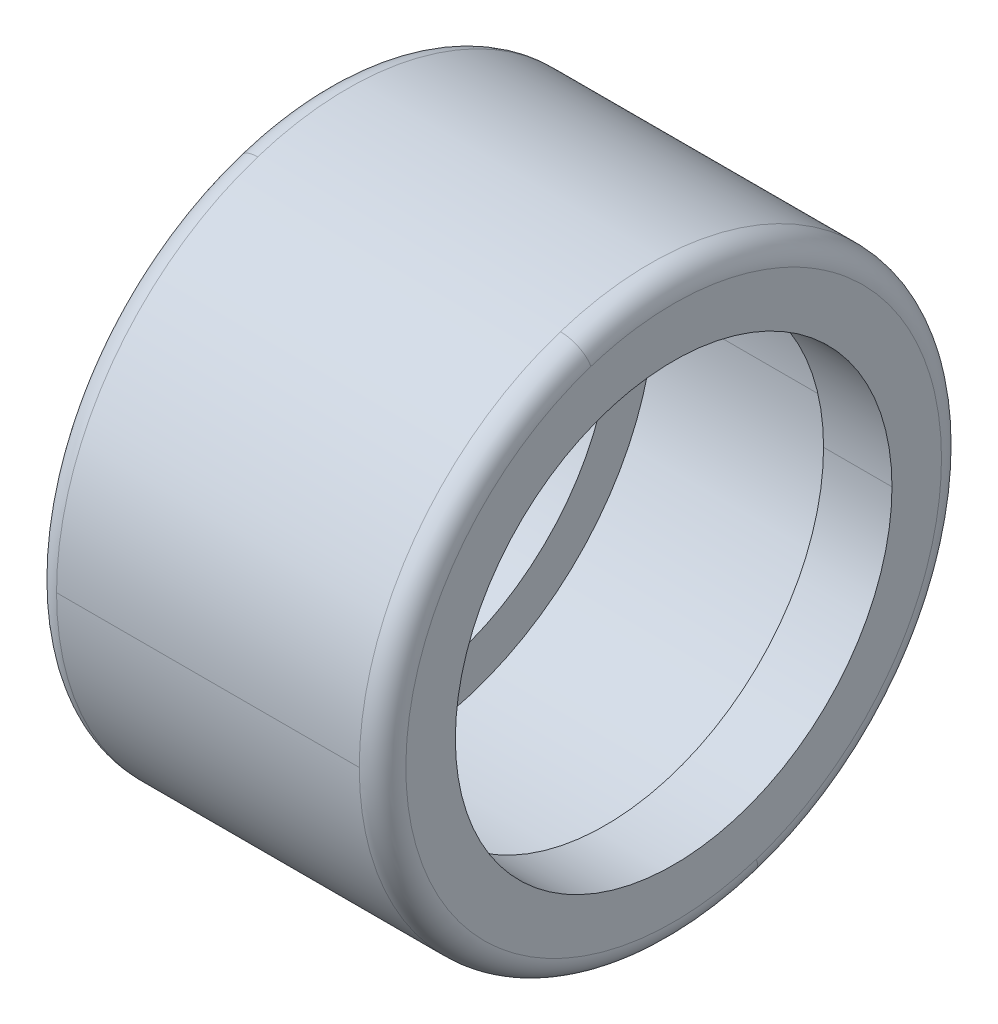
ISO-10303-21;
HEADER;
FILE_DESCRIPTION(('STEP AP214'),'2;1');
FILE_NAME('part.step','',(''),(''),'','','');
FILE_SCHEMA(('AUTOMOTIVE_DESIGN { 1 0 10303 214 1 1 1 1 }'));
ENDSEC;
DATA;
#1=APPLICATION_CONTEXT('core data for automotive mechanical design processes');
#2=APPLICATION_PROTOCOL_DEFINITION('international standard','automotive_design',2000,#1);
#3=PRODUCT_CONTEXT('',#1,'mechanical');
#4=PRODUCT('Part','Part','',(#3));
#5=PRODUCT_RELATED_PRODUCT_CATEGORY('part','',(#4));
#6=PRODUCT_DEFINITION_FORMATION('','',#4);
#7=PRODUCT_DEFINITION_CONTEXT('part definition',#1,'design');
#8=PRODUCT_DEFINITION('design','',#6,#7);
#9=PRODUCT_DEFINITION_SHAPE('','',#8);
#10=(LENGTH_UNIT() NAMED_UNIT(*) SI_UNIT(.MILLI.,.METRE.));
#11=(NAMED_UNIT(*) PLANE_ANGLE_UNIT() SI_UNIT($,.RADIAN.));
#12=(NAMED_UNIT(*) SI_UNIT($,.STERADIAN.) SOLID_ANGLE_UNIT());
#13=UNCERTAINTY_MEASURE_WITH_UNIT(LENGTH_MEASURE(1.E-05),#10,'distance_accuracy_value','');
#14=(GEOMETRIC_REPRESENTATION_CONTEXT(3) GLOBAL_UNCERTAINTY_ASSIGNED_CONTEXT((#13)) GLOBAL_UNIT_ASSIGNED_CONTEXT((#10,
#11,#12)) REPRESENTATION_CONTEXT('',''));
#15=CARTESIAN_POINT('',(0.,0.,0.));
#16=DIRECTION('',(0.,0.,1.));
#17=DIRECTION('',(1.,0.,0.));
#18=AXIS2_PLACEMENT_3D('',#15,#16,#17);
#19=CARTESIAN_POINT('',(0.80000000000006,0.,0.));
#20=DIRECTION('',(1.,0.,0.));
#21=DIRECTION('',(0.,-0.309016994374947,0.951056516295154));
#22=AXIS2_PLACEMENT_3D('',#19,#20,#21);
#23=TOROIDAL_SURFACE('',#22,9.2,0.800000000000061);
#24=CARTESIAN_POINT('',(0.80000000000006,-8.74971994991541,-2.84295634824951));
#25=DIRECTION('',(0.,0.309016994374947,-0.951056516295154));
#26=DIRECTION('',(0.,-0.951056516295154,-0.309016994374947));
#27=AXIS2_PLACEMENT_3D('',#24,#25,#26);
#28=CIRCLE('',#27,0.800000000000061);
#29=CARTESIAN_POINT('',(0.799999999999998,-9.51056516295159,-3.09016994374949));
#30=VERTEX_POINT('',#29);
#31=CARTESIAN_POINT('',(0.,-8.74971994991541,-2.84295634824951));
#32=VERTEX_POINT('',#31);
#33=EDGE_CURVE('E11',#30,#32,#28,.T.);
#34=ORIENTED_EDGE('',*,*,#33,.T.);
#35=CARTESIAN_POINT('',(0.,-8.74971994991541,-2.84295634824951));
#36=CARTESIAN_POINT('',(0.,-8.7032051754001,-2.98612443747712));
#37=CARTESIAN_POINT('',(0.,-8.65317067329749,-3.12814861219191));
#38=CARTESIAN_POINT('',(0.,-8.54619587234309,-3.40957197136774));
#39=CARTESIAN_POINT('',(0.,-8.48925557349131,-3.54897115582878));
#40=CARTESIAN_POINT('',(0.,-8.36860283746399,-3.824807373269));
#41=CARTESIAN_POINT('',(0.,-8.30489040028846,-3.96124440624817));
#42=CARTESIAN_POINT('',(0.,-8.17084781849556,-4.23082799004443));
#43=CARTESIAN_POINT('',(0.,-8.10051767387819,-4.36397454086151));
#44=CARTESIAN_POINT('',(0.,-7.95340885626128,-4.62665630268244));
#45=CARTESIAN_POINT('',(0.,-7.87663018326173,-4.75619151368629));
#46=CARTESIAN_POINT('',(0.,-7.71680934306418,-5.01133855992067));
#47=CARTESIAN_POINT('',(0.,-7.63376717586618,-5.13695039515121));
#48=CARTESIAN_POINT('',(0.,-7.46161938500327,-5.38394807303685));
#49=CARTESIAN_POINT('',(0.,-7.37251376133837,-5.50533391569195));
#50=CARTESIAN_POINT('',(0.,-7.18845372564979,-5.74358718114546));
#51=CARTESIAN_POINT('',(0.,-7.09349931362612,-5.86045460394387));
#52=CARTESIAN_POINT('',(0.,-6.89797045341445,-6.0893894853315));
#53=CARTESIAN_POINT('',(0.,-6.79739600522645,-6.20145694392072));
#54=CARTESIAN_POINT('',(0.,-6.59086936568973,-6.42052191669881));
#55=CARTESIAN_POINT('',(0.,-6.48491717434101,-6.52751943088768));
#56=CARTESIAN_POINT('',(0.,-6.2678902964987,-6.73618674844601));
#57=CARTESIAN_POINT('',(0.,-6.15681561000511,-6.83785655181546));
#58=CARTESIAN_POINT('',(0.,-5.92981133054686,-7.03562351628292));
#59=CARTESIAN_POINT('',(0.,-5.8138817375822,-7.13172067738093));
#60=CARTESIAN_POINT('',(0.,-5.57744692971877,-7.31811085082476));
#61=CARTESIAN_POINT('',(0.,-5.45694171482,-7.40840386317057));
#62=CARTESIAN_POINT('',(0.,-5.21164597070787,-7.58296821533522));
#63=CARTESIAN_POINT('',(0.,-5.0868554414945,-7.66723955515404));
#64=CARTESIAN_POINT('',(0.,-4.83328970006792,-7.82955754522561));
#65=CARTESIAN_POINT('',(0.,-4.70451448785471,-7.90760419547835));
#66=CARTESIAN_POINT('',(0.,-4.44328961119416,-8.05728478520124));
#67=CARTESIAN_POINT('',(0.,-4.31083994674682,-8.1289187246714));
#68=CARTESIAN_POINT('',(0.,-4.04258524846086,-8.26560132039455));
#69=CARTESIAN_POINT('',(0.,-3.90678021462225,-8.33064997664754));
#70=CARTESIAN_POINT('',(0.,-3.63214194377537,-8.45400529802585));
#71=CARTESIAN_POINT('',(0.,-3.49330870676711,-8.51231196315117));
#72=CARTESIAN_POINT('',(0.,-3.21294849100927,-8.6220428364108));
#73=CARTESIAN_POINT('',(0.,-3.07142151225968,-8.6734670445451));
#74=CARTESIAN_POINT('',(0.,-2.78601476390727,-8.76930911840108));
#75=CARTESIAN_POINT('',(0.,-2.64213499430445,-8.81372698412274));
#76=CARTESIAN_POINT('',(0.,-2.35236928321295,-8.89544936662436));
#77=CARTESIAN_POINT('',(0.,-2.20648334172426,-8.93275388340431));
#78=CARTESIAN_POINT('',(0.,-1.91305673887215,-9.0001596981741));
#79=CARTESIAN_POINT('',(0.,-1.76551607750873,-9.03026099616394));
#80=CARTESIAN_POINT('',(0.,-1.46913547328343,-9.08318785669006));
#81=CARTESIAN_POINT('',(0.,-1.32029553042154,-9.10601341922635));
#82=CARTESIAN_POINT('',(0.,-1.0216749316585,-9.14433382006596));
#83=CARTESIAN_POINT('',(0.,-0.871894275757341,-9.15982865836928));
#84=CARTESIAN_POINT('',(0.,-0.57175308563505,-9.18345028232027));
#85=CARTESIAN_POINT('',(0.,-0.421392551413917,-9.19157706796795));
#86=CARTESIAN_POINT('',(0.,-0.120453836348647,-9.20044300846923));
#87=CARTESIAN_POINT('',(0.,0.0301243444954906,-9.20118216332283));
#88=CARTESIAN_POINT('',(0.,0.331135596780027,-9.19527106154716));
#89=CARTESIAN_POINT('',(0.,0.481568668220426,-9.18862080491789));
#90=CARTESIAN_POINT('',(0.,0.781927295252005,-9.1679469012272));
#91=CARTESIAN_POINT('',(0.,0.931852850843185,-9.15392325416578));
#92=CARTESIAN_POINT('',(0.,1.23083526238098,-9.11853635380487));
#93=CARTESIAN_POINT('',(0.,1.37989211832759,-9.09717310050539));
#94=CARTESIAN_POINT('',(0.,1.67677803955444,-9.04715845361677));
#95=CARTESIAN_POINT('',(0.,1.82460710483467,-9.01850706002764));
#96=CARTESIAN_POINT('',(0.,2.11868131156221,-8.95398515627642));
#97=CARTESIAN_POINT('',(0.,2.26492645300951,-8.91811464611435));
#98=CARTESIAN_POINT('',(0.,2.55548049471585,-8.83924092441813));
#99=CARTESIAN_POINT('',(0.,2.69978939497491,-8.79623771288399));
#100=CARTESIAN_POINT('',(0.,2.98612330152407,-8.70320218694685));
#101=CARTESIAN_POINT('',(0.,3.12814830781419,-8.65316987254386));
#102=CARTESIAN_POINT('',(0.,3.40957227574541,-8.54619667309674));
#103=CARTESIAN_POINT('',(0.,3.54897123738652,-8.48925578805261));
#104=CARTESIAN_POINT('',(0.,3.82480729171122,-8.36860262290271));
#105=CARTESIAN_POINT('',(0.,3.96124438439482,-8.30489034279695));
#106=CARTESIAN_POINT('',(0.,4.23082801189774,-8.17084787598709));
#107=CARTESIAN_POINT('',(0.,4.36397454671708,-8.10051768928301));
#108=CARTESIAN_POINT('',(0.,4.62665629682684,-7.95340884085648));
#109=CARTESIAN_POINT('',(0.,4.75619151211727,-7.87663017913404));
#110=CARTESIAN_POINT('',(0.,5.01133856148965,-7.7168093471919));
#111=CARTESIAN_POINT('',(0.,5.1369503955716,-7.63376717697221));
#112=CARTESIAN_POINT('',(0.,5.38394807261641,-7.46161938389727));
#113=CARTESIAN_POINT('',(0.,5.50533391557928,-7.37251376104202));
#114=CARTESIAN_POINT('',(0.,5.74358718125809,-7.18845372594616));
#115=CARTESIAN_POINT('',(0.,5.86045460397403,-7.09349931370554));
#116=CARTESIAN_POINT('',(0.,6.08938948530129,-6.89797045333506));
#117=CARTESIAN_POINT('',(0.,6.20145694391261,-6.79739600520519));
#118=CARTESIAN_POINT('',(0.,6.42052191670688,-6.59086936571103));
#119=CARTESIAN_POINT('',(0.,6.52751943088983,-6.48491717434673));
#120=CARTESIAN_POINT('',(0.,6.73618674844382,-6.26789029649302));
#121=CARTESIAN_POINT('',(0.,6.83785655181486,-6.1568156100036));
#122=CARTESIAN_POINT('',(0.,7.03562351628349,-5.92981133054841));
#123=CARTESIAN_POINT('',(0.,7.13172067738107,-5.81388173758262));
#124=CARTESIAN_POINT('',(0.,7.31811085082458,-5.57744692971838));
#125=CARTESIAN_POINT('',(0.,7.40840386317051,-5.45694171481991));
#126=CARTESIAN_POINT('',(0.,7.58296821533524,-5.211645970708));
#127=CARTESIAN_POINT('',(0.,7.66723955515404,-5.08685544149455));
#128=CARTESIAN_POINT('',(0.,7.82955754522558,-4.83328970006792));
#129=CARTESIAN_POINT('',(0.,7.90760419547833,-4.70451448785472));
#130=CARTESIAN_POINT('',(0.,8.05728478520123,-4.44328961119419));
#131=CARTESIAN_POINT('',(0.,8.12891872467139,-4.31083994674684));
#132=CARTESIAN_POINT('',(0.,8.26560132039454,-4.04258524846088));
#133=CARTESIAN_POINT('',(0.,8.33064997664752,-3.90678021462227));
#134=CARTESIAN_POINT('',(0.,8.45400529802585,-3.63214194377539));
#135=CARTESIAN_POINT('',(0.,8.51231196315119,-3.49330870676713));
#136=CARTESIAN_POINT('',(0.,8.62204283641076,-3.2129484910093));
#137=CARTESIAN_POINT('',(0.,8.67346704454498,-3.07142151225973));
#138=CARTESIAN_POINT('',(0.,8.76930911840118,-2.78601476390726));
#139=CARTESIAN_POINT('',(0.,8.81372698412315,-2.64213499430436));
#140=CARTESIAN_POINT('',(0.,8.89544936662393,-2.35236928321308));
#141=CARTESIAN_POINT('',(0.,8.93275388340273,-2.20648334172471));
#142=CARTESIAN_POINT('',(0.,9.00015969817567,-1.91305673887175));
#143=CARTESIAN_POINT('',(0.,9.03026099616982,-1.76551607750716));
#144=CARTESIAN_POINT('',(0.,9.08318785668417,-1.46913547328505));
#145=CARTESIAN_POINT('',(0.,9.10601341920438,-1.32029553042753));
#146=CARTESIAN_POINT('',(0.,9.14433382008792,-1.02167493165256));
#147=CARTESIAN_POINT('',(0.,9.15982865845126,-0.871894275735111));
#148=CARTESIAN_POINT('',(0.,9.18345028223829,-0.571753085657331));
#149=CARTESIAN_POINT('',(0.,9.19157706766198,-0.421392551497003));
#150=CARTESIAN_POINT('',(0.,9.2004430087752,-0.120453836265618));
#151=CARTESIAN_POINT('',(0.,9.20118216446473,0.0301243448054401));
#152=CARTESIAN_POINT('',(0.,9.19527106040526,0.331135596470018));
#153=CARTESIAN_POINT('',(0.,9.18862080065627,0.481568667063538));
#154=CARTESIAN_POINT('',(0.,9.16794690548882,0.781927296408833));
#155=CARTESIAN_POINT('',(0.,9.15392327007035,0.931852855160607));
#156=CARTESIAN_POINT('',(0.,9.1185363379003,1.2308352580635));
#157=CARTESIAN_POINT('',(0.,9.09717304114871,1.37989210221462));
#158=CARTESIAN_POINT('',(0.,9.04715851297347,1.67677805566737));
#159=CARTESIAN_POINT('',(0.,9.01850728154982,1.824607164969));
#160=CARTESIAN_POINT('',(0.,8.95398493475425,2.11868125142783));
#161=CARTESIAN_POINT('',(0.,8.91811381938233,2.26492622858503));
#162=CARTESIAN_POINT('',(0.,8.83924175115016,2.55548071914028));
#163=CARTESIAN_POINT('',(0.,8.7962407982899,2.69979023253834));
#164=CARTESIAN_POINT('',(0.,8.74971994991543,2.84295634824947));
#165=B_SPLINE_CURVE_WITH_KNOTS('',3,(#35,#36,#37,#38,#39,#40,#41,#42,#43,#44,#45,#46,#47,#48,
#49,#50,#51,#52,#53,#54,#55,#56,#57,#58,#59,#60,#61,#62,#63,#64,#65,#66,#67,#68,#69,#70,#71,#72,
#73,#74,#75,#76,#77,#78,#79,#80,#81,#82,#83,#84,#85,#86,#87,#88,#89,#90,#91,#92,#93,#94,#95,#96,
#97,#98,#99,#100,#101,#102,#103,#104,#105,#106,#107,#108,#109,#110,#111,#112,#113,#114,#115,
#116,#117,#118,#119,#120,#121,#122,#123,#124,#125,#126,#127,#128,#129,#130,#131,#132,#133,#134,
#135,#136,#137,#138,#139,#140,#141,#142,#143,#144,#145,#146,#147,#148,#149,#150,#151,#152,#153,
#154,#155,#156,#157,#158,#159,#160,#161,#162,#163,#164),.UNSPECIFIED.,.F.,.F.,(4,2,2,2,2,2,2,2,
2,2,2,2,2,2,2,2,2,2,2,2,2,2,2,2,2,2,2,2,2,2,2,2,2,2,2,2,2,2,2,2,2,2,2,2,2,2,2,2,2,2,2,2,2,2,2,2,
2,2,2,2,2,2,2,2,4),(0.,0.451558604821586,0.903117209643169,1.35467581446475,1.80623441928634,
2.25779302410793,2.70935162892951,3.1609102337511,3.61246883857268,4.06402744339427,
4.51558604821585,4.96714465303744,5.41870325785902,5.87026186268061,6.32182046750219,
6.77337907232378,7.22493767714536,7.67649628196695,8.12805488678854,8.57961349161012,
9.03117209643171,9.48273070125329,9.93428930607488,10.3858479108965,10.837406515718,
11.2889651205396,11.7405237253612,12.1920823301828,12.6436409350044,13.095199539826,
13.5467581446476,13.9983167494691,14.4498753542907,14.9014339591123,15.3529925639339,
15.8045511687555,16.2561097735771,16.7076683783987,17.1592269832202,17.6107855880418,
18.0623441928634,18.513902797685,18.9654614025066,19.4170200073282,19.8685786121498,
20.3201372169713,20.7716958217929,21.2232544266145,21.6748130314361,22.1263716362577,
22.5779302410793,23.0294888459008,23.4810474507224,23.932606055544,24.3841646603656,
24.8357232651872,25.2872818700088,25.7388404748303,26.1903990796519,26.6419576844735,
27.0935162892951,27.5450748941167,27.9966334989383,28.4481921037599,28.8997507085814),.UNSPECIFIED.);
#166=CARTESIAN_POINT('',(0.,8.74971994991541,2.84295634824951));
#167=VERTEX_POINT('',#166);
#168=EDGE_CURVE('E25',#32,#167,#165,.T.);
#169=ORIENTED_EDGE('',*,*,#168,.T.);
#170=CARTESIAN_POINT('',(0.80000000000006,8.74971994991541,2.84295634824952));
#171=DIRECTION('',(0.,-0.309016994374948,0.951056516295154));
#172=DIRECTION('',(0.,0.951056516295154,0.309016994374948));
#173=AXIS2_PLACEMENT_3D('',#170,#171,#172);
#174=CIRCLE('',#173,0.800000000000061);
#175=CARTESIAN_POINT('',(0.799999999999998,9.51056516295159,3.09016994374949));
#176=VERTEX_POINT('',#175);
#177=EDGE_CURVE('E297',#176,#167,#174,.T.);
#178=ORIENTED_EDGE('',*,*,#177,.F.);
#179=CARTESIAN_POINT('',(0.8,0.,0.));
#180=DIRECTION('',(1.,0.,0.));
#181=DIRECTION('',(0.,0.,-1.));
#182=AXIS2_PLACEMENT_3D('',#179,#180,#181);
#183=CIRCLE('',#182,10.);
#184=CARTESIAN_POINT('',(0.8,0.,-10.));
#185=VERTEX_POINT('',#184);
#186=EDGE_CURVE('E292',#185,#176,#183,.T.);
#187=ORIENTED_EDGE('',*,*,#186,.F.);
#188=CARTESIAN_POINT('',(0.8,0.,0.));
#189=DIRECTION('',(1.,0.,0.));
#190=DIRECTION('',(0.,0.,-1.));
#191=AXIS2_PLACEMENT_3D('',#188,#189,#190);
#192=CIRCLE('',#191,10.);
#193=EDGE_CURVE('E287',#30,#185,#192,.T.);
#194=ORIENTED_EDGE('',*,*,#193,.F.);
#195=EDGE_LOOP('',(#34,#169,#178,#187,#194));
#196=FACE_BOUND('',#195,.T.);
#197=ADVANCED_FACE('F16',(#196),#23,.T.);
#198=CARTESIAN_POINT('',(50.,0.,0.));
#199=DIRECTION('',(1.,0.,0.));
#200=DIRECTION('',(0.,1.,0.));
#201=AXIS2_PLACEMENT_3D('',#198,#199,#200);
#202=CYLINDRICAL_SURFACE('',#201,10.);
#203=DIRECTION('',(1.,0.,0.));
#204=VECTOR('',#203,1.);
#205=CARTESIAN_POINT('',(0.799999999999997,0.,10.));
#206=LINE('',#205,#204);
#207=CARTESIAN_POINT('',(0.799999999999997,0.,10.));
#208=VERTEX_POINT('',#207);
#209=CARTESIAN_POINT('',(11.2,0.,10.));
#210=VERTEX_POINT('',#209);
#211=EDGE_CURVE('E282',#208,#210,#206,.T.);
#212=ORIENTED_EDGE('',*,*,#211,.F.);
#213=CARTESIAN_POINT('',(0.8,0.,0.));
#214=DIRECTION('',(1.,0.,0.));
#215=DIRECTION('',(0.,0.,-1.));
#216=AXIS2_PLACEMENT_3D('',#213,#214,#215);
#217=CIRCLE('',#216,10.);
#218=EDGE_CURVE('E277',#208,#30,#217,.T.);
#219=ORIENTED_EDGE('',*,*,#218,.T.);
#220=ORIENTED_EDGE('',*,*,#193,.T.);
#221=DIRECTION('',(1.,0.,0.));
#222=VECTOR('',#221,1.);
#223=CARTESIAN_POINT('',(0.799999999999997,0.,-10.));
#224=LINE('',#223,#222);
#225=CARTESIAN_POINT('',(11.2,0.,-10.));
#226=VERTEX_POINT('',#225);
#227=EDGE_CURVE('E273',#185,#226,#224,.T.);
#228=ORIENTED_EDGE('',*,*,#227,.T.);
#229=CARTESIAN_POINT('',(11.2,0.,0.));
#230=DIRECTION('',(1.,0.,0.));
#231=DIRECTION('',(0.,0.,-1.));
#232=AXIS2_PLACEMENT_3D('',#229,#230,#231);
#233=CIRCLE('',#232,10.);
#234=CARTESIAN_POINT('',(11.2,-9.51056516295154,-3.09016994374947));
#235=VERTEX_POINT('',#234);
#236=EDGE_CURVE('E268',#235,#226,#233,.T.);
#237=ORIENTED_EDGE('',*,*,#236,.F.);
#238=CARTESIAN_POINT('',(11.2,0.,0.));
#239=DIRECTION('',(1.,0.,0.));
#240=DIRECTION('',(0.,0.,-1.));
#241=AXIS2_PLACEMENT_3D('',#238,#239,#240);
#242=CIRCLE('',#241,10.);
#243=EDGE_CURVE('E263',#210,#235,#242,.T.);
#244=ORIENTED_EDGE('',*,*,#243,.F.);
#245=EDGE_LOOP('',(#212,#219,#220,#228,#237,#244));
#246=FACE_BOUND('',#245,.T.);
#247=ADVANCED_FACE('F315',(#246),#202,.T.);
#248=CARTESIAN_POINT('',(11.1999999999995,0.,0.));
#249=DIRECTION('',(1.,0.,0.));
#250=DIRECTION('',(0.,0.309016994374947,-0.951056516295154));
#251=AXIS2_PLACEMENT_3D('',#248,#249,#250);
#252=TOROIDAL_SURFACE('',#251,9.19999999999953,0.800000000000471);
#253=CARTESIAN_POINT('',(11.1999999999995,-8.74971994991497,-2.84295634824937));
#254=DIRECTION('',(0.,0.309016994374947,-0.951056516295154));
#255=DIRECTION('',(1.,0.,0.));
#256=AXIS2_PLACEMENT_3D('',#253,#254,#255);
#257=CIRCLE('',#256,0.800000000000471);
#258=CARTESIAN_POINT('',(12.,-8.74971994991497,-2.84295634824937));
#259=VERTEX_POINT('',#258);
#260=EDGE_CURVE('E258',#259,#235,#257,.T.);
#261=ORIENTED_EDGE('',*,*,#260,.F.);
#262=CARTESIAN_POINT('',(12.,0.,0.));
#263=DIRECTION('',(1.,0.,0.));
#264=DIRECTION('',(0.,0.,-1.));
#265=AXIS2_PLACEMENT_3D('',#262,#263,#264);
#266=CIRCLE('',#265,9.2);
#267=CARTESIAN_POINT('',(12.,8.74971994991497,2.84295634824937));
#268=VERTEX_POINT('',#267);
#269=EDGE_CURVE('E253',#268,#259,#266,.T.);
#270=ORIENTED_EDGE('',*,*,#269,.F.);
#271=CARTESIAN_POINT('',(11.1999999999995,8.74971994991497,2.84295634824937));
#272=DIRECTION('',(0.,-0.309016994374947,0.951056516295154));
#273=DIRECTION('',(1.,0.,0.));
#274=AXIS2_PLACEMENT_3D('',#271,#272,#273);
#275=CIRCLE('',#274,0.800000000000471);
#276=CARTESIAN_POINT('',(11.2,9.51056516295154,3.09016994374947));
#277=VERTEX_POINT('',#276);
#278=EDGE_CURVE('E249',#268,#277,#275,.T.);
#279=ORIENTED_EDGE('',*,*,#278,.T.);
#280=CARTESIAN_POINT('',(11.2,0.,0.));
#281=DIRECTION('',(1.,0.,0.));
#282=DIRECTION('',(0.,0.,-1.));
#283=AXIS2_PLACEMENT_3D('',#280,#281,#282);
#284=CIRCLE('',#283,10.);
#285=EDGE_CURVE('E244',#277,#210,#284,.T.);
#286=ORIENTED_EDGE('',*,*,#285,.T.);
#287=ORIENTED_EDGE('',*,*,#243,.T.);
#288=EDGE_LOOP('',(#261,#270,#279,#286,#287));
#289=FACE_BOUND('',#288,.T.);
#290=ADVANCED_FACE('F324',(#289),#252,.T.);
#291=CARTESIAN_POINT('',(50.,0.,0.));
#292=DIRECTION('',(1.,0.,0.));
#293=DIRECTION('',(0.,-1.,0.));
#294=AXIS2_PLACEMENT_3D('',#291,#292,#293);
#295=CYLINDRICAL_SURFACE('',#294,10.);
#296=ORIENTED_EDGE('',*,*,#211,.T.);
#297=ORIENTED_EDGE('',*,*,#285,.F.);
#298=CARTESIAN_POINT('',(11.2,0.,0.));
#299=DIRECTION('',(1.,0.,0.));
#300=DIRECTION('',(0.,0.,-1.));
#301=AXIS2_PLACEMENT_3D('',#298,#299,#300);
#302=CIRCLE('',#301,10.);
#303=EDGE_CURVE('E239',#226,#277,#302,.T.);
#304=ORIENTED_EDGE('',*,*,#303,.F.);
#305=ORIENTED_EDGE('',*,*,#227,.F.);
#306=ORIENTED_EDGE('',*,*,#186,.T.);
#307=CARTESIAN_POINT('',(0.8,0.,0.));
#308=DIRECTION('',(1.,0.,0.));
#309=DIRECTION('',(0.,0.,-1.));
#310=AXIS2_PLACEMENT_3D('',#307,#308,#309);
#311=CIRCLE('',#310,10.);
#312=EDGE_CURVE('E236',#176,#208,#311,.T.);
#313=ORIENTED_EDGE('',*,*,#312,.T.);
#314=EDGE_LOOP('',(#296,#297,#304,#305,#306,#313));
#315=FACE_BOUND('',#314,.T.);
#316=ADVANCED_FACE('F317',(#315),#295,.T.);
#317=CARTESIAN_POINT('',(0.80000000000006,0.,0.));
#318=DIRECTION('',(1.,0.,0.));
#319=DIRECTION('',(0.,0.309016994374947,-0.951056516295154));
#320=AXIS2_PLACEMENT_3D('',#317,#318,#319);
#321=TOROIDAL_SURFACE('',#320,9.2,0.800000000000061);
#322=ORIENTED_EDGE('',*,*,#33,.F.);
#323=ORIENTED_EDGE('',*,*,#218,.F.);
#324=ORIENTED_EDGE('',*,*,#312,.F.);
#325=ORIENTED_EDGE('',*,*,#177,.T.);
#326=CARTESIAN_POINT('',(0.,8.74971994991541,2.84295634824952));
#327=CARTESIAN_POINT('',(0.,8.7032051754001,2.98612443747712));
#328=CARTESIAN_POINT('',(0.,8.65317067329749,3.12814861219191));
#329=CARTESIAN_POINT('',(0.,8.54619587234309,3.40957197136774));
#330=CARTESIAN_POINT('',(0.,8.48925557349131,3.54897115582879));
#331=CARTESIAN_POINT('',(0.,8.36860283746399,3.824807373269));
#332=CARTESIAN_POINT('',(0.,8.30489040028846,3.96124440624818));
#333=CARTESIAN_POINT('',(0.,8.17084781849556,4.23082799004443));
#334=CARTESIAN_POINT('',(0.,8.10051767387819,4.36397454086152));
#335=CARTESIAN_POINT('',(0.,7.95340885626128,4.62665630268245));
#336=CARTESIAN_POINT('',(0.,7.87663018326173,4.75619151368629));
#337=CARTESIAN_POINT('',(0.,7.71680934306418,5.01133855992067));
#338=CARTESIAN_POINT('',(0.,7.63376717586618,5.13695039515121));
#339=CARTESIAN_POINT('',(0.,7.46161938500327,5.38394807303685));
#340=CARTESIAN_POINT('',(0.,7.37251376133836,5.50533391569195));
#341=CARTESIAN_POINT('',(0.,7.18845372564979,5.74358718114546));
#342=CARTESIAN_POINT('',(0.,7.09349931362612,5.86045460394387));
#343=CARTESIAN_POINT('',(0.,6.89797045341445,6.0893894853315));
#344=CARTESIAN_POINT('',(0.,6.79739600522645,6.20145694392072));
#345=CARTESIAN_POINT('',(0.,6.59086936568973,6.42052191669882));
#346=CARTESIAN_POINT('',(0.,6.48491717434101,6.52751943088769));
#347=CARTESIAN_POINT('',(0.,6.2678902964987,6.73618674844601));
#348=CARTESIAN_POINT('',(0.,6.15681561000511,6.83785655181546));
#349=CARTESIAN_POINT('',(0.,5.92981133054686,7.03562351628293));
#350=CARTESIAN_POINT('',(0.,5.81388173758219,7.13172067738094));
#351=CARTESIAN_POINT('',(0.,5.57744692971876,7.31811085082476));
#352=CARTESIAN_POINT('',(0.,5.45694171482,7.40840386317057));
#353=CARTESIAN_POINT('',(0.,5.21164597070787,7.58296821533522));
#354=CARTESIAN_POINT('',(0.,5.0868554414945,7.66723955515405));
#355=CARTESIAN_POINT('',(0.,4.83328970006792,7.82955754522561));
#356=CARTESIAN_POINT('',(0.,4.7045144878547,7.90760419547835));
#357=CARTESIAN_POINT('',(0.,4.44328961119415,8.05728478520125));
#358=CARTESIAN_POINT('',(0.,4.31083994674682,8.1289187246714));
#359=CARTESIAN_POINT('',(0.,4.04258524846086,8.26560132039455));
#360=CARTESIAN_POINT('',(0.,3.90678021462224,8.33064997664754));
#361=CARTESIAN_POINT('',(0.,3.63214194377537,8.45400529802585));
#362=CARTESIAN_POINT('',(0.,3.49330870676711,8.51231196315118));
#363=CARTESIAN_POINT('',(0.,3.21294849100926,8.6220428364108));
#364=CARTESIAN_POINT('',(0.,3.07142151225967,8.67346704454511));
#365=CARTESIAN_POINT('',(0.,2.78601476390726,8.76930911840108));
#366=CARTESIAN_POINT('',(0.,2.64213499430445,8.81372698412274));
#367=CARTESIAN_POINT('',(0.,2.35236928321294,8.89544936662436));
#368=CARTESIAN_POINT('',(0.,2.20648334172425,8.93275388340431));
#369=CARTESIAN_POINT('',(0.,1.91305673887214,9.0001596981741));
#370=CARTESIAN_POINT('',(0.,1.76551607750872,9.03026099616394));
#371=CARTESIAN_POINT('',(0.,1.46913547328342,9.08318785669006));
#372=CARTESIAN_POINT('',(0.,1.32029553042154,9.10601341922635));
#373=CARTESIAN_POINT('',(0.,1.02167493165849,9.14433382006596));
#374=CARTESIAN_POINT('',(0.,0.871894275757333,9.15982865836928));
#375=CARTESIAN_POINT('',(0.,0.571753085635041,9.18345028232027));
#376=CARTESIAN_POINT('',(0.,0.421392551413908,9.19157706796796));
#377=CARTESIAN_POINT('',(0.,0.120453836348639,9.20044300846923));
#378=CARTESIAN_POINT('',(0.,-0.0301243444954969,9.20118216332283));
#379=CARTESIAN_POINT('',(0.,-0.331135596780033,9.19527106154716));
#380=CARTESIAN_POINT('',(0.,-0.481568668220434,9.18862080491789));
#381=CARTESIAN_POINT('',(0.,-0.781927295252014,9.1679469012272));
#382=CARTESIAN_POINT('',(0.,-0.931852850843193,9.15392325416577));
#383=CARTESIAN_POINT('',(0.,-1.23083526238099,9.11853635380487));
#384=CARTESIAN_POINT('',(0.,-1.3798921183276,9.09717310050539));
#385=CARTESIAN_POINT('',(0.,-1.67677803955445,9.04715845361677));
#386=CARTESIAN_POINT('',(0.,-1.82460710483469,9.01850706002763));
#387=CARTESIAN_POINT('',(0.,-2.11868131156222,8.95398515627642));
#388=CARTESIAN_POINT('',(0.,-2.26492645300951,8.91811464611435));
#389=CARTESIAN_POINT('',(0.,-2.55548049471586,8.83924092441813));
#390=CARTESIAN_POINT('',(0.,-2.69978939497491,8.79623771288398));
#391=CARTESIAN_POINT('',(0.,-2.98612330152408,8.70320218694685));
#392=CARTESIAN_POINT('',(0.,-3.1281483078142,8.65316987254386));
#393=CARTESIAN_POINT('',(0.,-3.40957227574542,8.54619667309674));
#394=CARTESIAN_POINT('',(0.,-3.54897123738653,8.4892557880526));
#395=CARTESIAN_POINT('',(0.,-3.82480729171123,8.36860262290271));
#396=CARTESIAN_POINT('',(0.,-3.96124438439482,8.30489034279695));
#397=CARTESIAN_POINT('',(0.,-4.23082801189775,8.1708478759871));
#398=CARTESIAN_POINT('',(0.,-4.36397454671709,8.10051768928301));
#399=CARTESIAN_POINT('',(0.,-4.62665629682685,7.95340884085648));
#400=CARTESIAN_POINT('',(0.,-4.75619151211728,7.87663017913404));
#401=CARTESIAN_POINT('',(0.,-5.01133856148966,7.7168093471919));
#402=CARTESIAN_POINT('',(0.,-5.13695039557161,7.63376717697221));
#403=CARTESIAN_POINT('',(0.,-5.38394807261642,7.46161938389726));
#404=CARTESIAN_POINT('',(0.,-5.50533391557929,7.37251376104202));
#405=CARTESIAN_POINT('',(0.,-5.7435871812581,7.18845372594615));
#406=CARTESIAN_POINT('',(0.,-5.86045460397404,7.09349931370554));
#407=CARTESIAN_POINT('',(0.,-6.0893894853013,6.89797045333505));
#408=CARTESIAN_POINT('',(0.,-6.20145694391262,6.79739600520519));
#409=CARTESIAN_POINT('',(0.,-6.42052191670689,6.59086936571102));
#410=CARTESIAN_POINT('',(0.,-6.52751943088984,6.48491717434672));
#411=CARTESIAN_POINT('',(0.,-6.73618674844383,6.26789029649301));
#412=CARTESIAN_POINT('',(0.,-6.83785655181487,6.15681561000359));
#413=CARTESIAN_POINT('',(0.,-7.0356235162835,5.92981133054839));
#414=CARTESIAN_POINT('',(0.,-7.13172067738108,5.81388173758261));
#415=CARTESIAN_POINT('',(0.,-7.31811085082459,5.57744692971837));
#416=CARTESIAN_POINT('',(0.,-7.40840386317052,5.4569417148199));
#417=CARTESIAN_POINT('',(0.,-7.58296821533525,5.21164597070799));
#418=CARTESIAN_POINT('',(0.,-7.66723955515405,5.08685544149454));
#419=CARTESIAN_POINT('',(0.,-7.82955754522559,4.8332897000679));
#420=CARTESIAN_POINT('',(0.,-7.90760419547834,4.70451448785471));
#421=CARTESIAN_POINT('',(0.,-8.05728478520124,4.44328961119418));
#422=CARTESIAN_POINT('',(0.,-8.1289187246714,4.31083994674683));
#423=CARTESIAN_POINT('',(0.,-8.26560132039454,4.04258524846087));
#424=CARTESIAN_POINT('',(0.,-8.33064997664753,3.90678021462226));
#425=CARTESIAN_POINT('',(0.,-8.45400529802586,3.63214194377538));
#426=CARTESIAN_POINT('',(0.,-8.5123119631512,3.49330870676711));
#427=CARTESIAN_POINT('',(0.,-8.62204283641077,3.21294849100928));
#428=CARTESIAN_POINT('',(0.,-8.67346704454499,3.07142151225972));
#429=CARTESIAN_POINT('',(0.,-8.76930911840118,2.78601476390725));
#430=CARTESIAN_POINT('',(0.,-8.81372698412316,2.64213499430435));
#431=CARTESIAN_POINT('',(0.,-8.89544936662393,2.35236928321307));
#432=CARTESIAN_POINT('',(0.,-8.93275388340273,2.2064833417247));
#433=CARTESIAN_POINT('',(0.,-9.00015969817568,1.91305673887173));
#434=CARTESIAN_POINT('',(0.,-9.03026099616982,1.76551607750714));
#435=CARTESIAN_POINT('',(0.,-9.08318785668417,1.46913547328504));
#436=CARTESIAN_POINT('',(0.,-9.10601341920438,1.32029553042752));
#437=CARTESIAN_POINT('',(0.,-9.14433382008793,1.02167493165255));
#438=CARTESIAN_POINT('',(0.,-9.15982865845126,0.871894275735096));
#439=CARTESIAN_POINT('',(0.,-9.18345028223829,0.571753085657314));
#440=CARTESIAN_POINT('',(0.,-9.19157706766198,0.421392551496986));
#441=CARTESIAN_POINT('',(0.,-9.2004430087752,0.1204538362656));
#442=CARTESIAN_POINT('',(0.,-9.20118216446473,-0.0301243448054577));
#443=CARTESIAN_POINT('',(0.,-9.19527106040526,-0.331135596470036));
#444=CARTESIAN_POINT('',(0.,-9.18862080065627,-0.481568667063556));
#445=CARTESIAN_POINT('',(0.,-9.16794690548881,-0.781927296408851));
#446=CARTESIAN_POINT('',(0.,-9.15392327007035,-0.931852855160625));
#447=CARTESIAN_POINT('',(0.,-9.1185363379003,-1.23083525806351));
#448=CARTESIAN_POINT('',(0.,-9.0971730411487,-1.37989210221463));
#449=CARTESIAN_POINT('',(0.,-9.04715851297346,-1.67677805566738));
#450=CARTESIAN_POINT('',(0.,-9.01850728154981,-1.82460716496901));
#451=CARTESIAN_POINT('',(0.,-8.95398493475425,-2.11868125142784));
#452=CARTESIAN_POINT('',(0.,-8.91811381938233,-2.26492622858504));
#453=CARTESIAN_POINT('',(0.,-8.83924175115015,-2.55548071914029));
#454=CARTESIAN_POINT('',(0.,-8.79624079828989,-2.69979023253835));
#455=CARTESIAN_POINT('',(0.,-8.74971994991542,-2.84295634824948));
#456=B_SPLINE_CURVE_WITH_KNOTS('',3,(#326,#327,#328,#329,#330,#331,#332,#333,#334,#335,#336,
#337,#338,#339,#340,#341,#342,#343,#344,#345,#346,#347,#348,#349,#350,#351,#352,#353,#354,#355,
#356,#357,#358,#359,#360,#361,#362,#363,#364,#365,#366,#367,#368,#369,#370,#371,#372,#373,#374,
#375,#376,#377,#378,#379,#380,#381,#382,#383,#384,#385,#386,#387,#388,#389,#390,#391,#392,#393,
#394,#395,#396,#397,#398,#399,#400,#401,#402,#403,#404,#405,#406,#407,#408,#409,#410,#411,#412,
#413,#414,#415,#416,#417,#418,#419,#420,#421,#422,#423,#424,#425,#426,#427,#428,#429,#430,#431,
#432,#433,#434,#435,#436,#437,#438,#439,#440,#441,#442,#443,#444,#445,#446,#447,#448,#449,#450,
#451,#452,#453,#454,#455),.UNSPECIFIED.,.F.,.F.,(4,2,2,2,2,2,2,2,2,2,2,2,2,2,2,2,2,2,2,2,2,2,2,
2,2,2,2,2,2,2,2,2,2,2,2,2,2,2,2,2,2,2,2,2,2,2,2,2,2,2,2,2,2,2,2,2,2,2,2,2,2,2,2,2,4),(0.,
0.451558604821586,0.90311720964317,1.35467581446476,1.80623441928634,2.25779302410793,
2.70935162892951,3.1609102337511,3.61246883857268,4.06402744339427,4.51558604821585,
4.96714465303744,5.41870325785903,5.87026186268061,6.3218204675022,6.77337907232378,
7.22493767714537,7.67649628196695,8.12805488678854,8.57961349161013,9.03117209643171,
9.4827307012533,9.93428930607488,10.3858479108965,10.8374065157181,11.2889651205396,
11.7405237253612,12.1920823301828,12.6436409350044,13.095199539826,13.5467581446476,
13.9983167494692,14.4498753542907,14.9014339591123,15.3529925639339,15.8045511687555,
16.2561097735771,16.7076683783987,17.1592269832203,17.6107855880418,18.0623441928634,
18.513902797685,18.9654614025066,19.4170200073282,19.8685786121498,20.3201372169714,
20.7716958217929,21.2232544266145,21.6748130314361,22.1263716362577,22.5779302410793,
23.0294888459009,23.4810474507224,23.932606055544,24.3841646603656,24.8357232651872,
25.2872818700088,25.7388404748304,26.190399079652,26.6419576844735,27.0935162892951,
27.5450748941167,27.9966334989383,28.4481921037599,28.8997507085815),.UNSPECIFIED.);
#457=EDGE_CURVE('E222',#167,#32,#456,.T.);
#458=ORIENTED_EDGE('',*,*,#457,.T.);
#459=EDGE_LOOP('',(#322,#323,#324,#325,#458));
#460=FACE_BOUND('',#459,.T.);
#461=ADVANCED_FACE('F201',(#460),#321,.T.);
#462=CARTESIAN_POINT('',(0.,9.2,0.));
#463=DIRECTION('',(-1.,0.,0.));
#464=DIRECTION('',(0.,0.,1.));
#465=AXIS2_PLACEMENT_3D('',#462,#463,#464);
#466=PLANE('',#465);
#467=CARTESIAN_POINT('',(0.,0.,0.));
#468=DIRECTION('',(1.,0.,0.));
#469=DIRECTION('',(0.,0.,-1.));
#470=AXIS2_PLACEMENT_3D('',#467,#468,#469);
#471=CIRCLE('',#470,7.5);
#472=CARTESIAN_POINT('',(0.,0.,-7.5));
#473=VERTEX_POINT('',#472);
#474=CARTESIAN_POINT('',(0.,0.,7.5));
#475=VERTEX_POINT('',#474);
#476=EDGE_CURVE('E218',#473,#475,#471,.T.);
#477=ORIENTED_EDGE('',*,*,#476,.T.);
#478=CARTESIAN_POINT('',(0.,0.,0.));
#479=DIRECTION('',(1.,0.,0.));
#480=DIRECTION('',(0.,0.,-1.));
#481=AXIS2_PLACEMENT_3D('',#478,#479,#480);
#482=CIRCLE('',#481,7.5);
#483=EDGE_CURVE('E182',#475,#473,#482,.T.);
#484=ORIENTED_EDGE('',*,*,#483,.T.);
#485=EDGE_LOOP('',(#477,#484));
#486=FACE_BOUND('',#485,.T.);
#487=ORIENTED_EDGE('',*,*,#168,.F.);
#488=ORIENTED_EDGE('',*,*,#457,.F.);
#489=EDGE_LOOP('',(#487,#488));
#490=FACE_BOUND('',#489,.T.);
#491=ADVANCED_FACE('F190',(#486,#490),#466,.T.);
#492=CARTESIAN_POINT('',(50.,0.,0.));
#493=DIRECTION('',(1.,0.,0.));
#494=DIRECTION('',(0.,1.,0.));
#495=AXIS2_PLACEMENT_3D('',#492,#493,#494);
#496=CYLINDRICAL_SURFACE('',#495,7.5);
#497=DIRECTION('',(1.,0.,0.));
#498=VECTOR('',#497,1.);
#499=CARTESIAN_POINT('',(0.,0.,7.5));
#500=LINE('',#499,#498);
#501=CARTESIAN_POINT('',(2.35,0.,7.5));
#502=VERTEX_POINT('',#501);
#503=EDGE_CURVE('E178',#475,#502,#500,.T.);
#504=ORIENTED_EDGE('',*,*,#503,.T.);
#505=CARTESIAN_POINT('',(2.35,0.,0.));
#506=DIRECTION('',(1.,0.,0.));
#507=DIRECTION('',(0.,0.,-1.));
#508=AXIS2_PLACEMENT_3D('',#505,#506,#507);
#509=CIRCLE('',#508,7.5);
#510=CARTESIAN_POINT('',(2.35,0.,-7.5));
#511=VERTEX_POINT('',#510);
#512=EDGE_CURVE('E174',#502,#511,#509,.T.);
#513=ORIENTED_EDGE('',*,*,#512,.T.);
#514=DIRECTION('',(1.,0.,0.));
#515=VECTOR('',#514,1.);
#516=CARTESIAN_POINT('',(0.,0.,-7.5));
#517=LINE('',#516,#515);
#518=EDGE_CURVE('E169',#473,#511,#517,.T.);
#519=ORIENTED_EDGE('',*,*,#518,.F.);
#520=ORIENTED_EDGE('',*,*,#483,.F.);
#521=EDGE_LOOP('',(#504,#513,#519,#520));
#522=FACE_BOUND('',#521,.T.);
#523=ADVANCED_FACE('F200',(#522),#496,.F.);
#524=CARTESIAN_POINT('',(50.,0.,0.));
#525=DIRECTION('',(1.,0.,0.));
#526=DIRECTION('',(0.,-1.,0.));
#527=AXIS2_PLACEMENT_3D('',#524,#525,#526);
#528=CYLINDRICAL_SURFACE('',#527,7.5);
#529=ORIENTED_EDGE('',*,*,#503,.F.);
#530=ORIENTED_EDGE('',*,*,#476,.F.);
#531=ORIENTED_EDGE('',*,*,#518,.T.);
#532=CARTESIAN_POINT('',(2.35,0.,0.));
#533=DIRECTION('',(1.,0.,0.));
#534=DIRECTION('',(0.,0.,-1.));
#535=AXIS2_PLACEMENT_3D('',#532,#533,#534);
#536=CIRCLE('',#535,7.5);
#537=EDGE_CURVE('E164',#511,#502,#536,.T.);
#538=ORIENTED_EDGE('',*,*,#537,.T.);
#539=EDGE_LOOP('',(#529,#530,#531,#538));
#540=FACE_BOUND('',#539,.T.);
#541=ADVANCED_FACE('F368',(#540),#528,.F.);
#542=CARTESIAN_POINT('',(2.35,7.5,0.));
#543=DIRECTION('',(1.,0.,0.));
#544=DIRECTION('',(0.,0.,-1.));
#545=AXIS2_PLACEMENT_3D('',#542,#543,#544);
#546=PLANE('',#545);
#547=CARTESIAN_POINT('',(2.35,0.,0.));
#548=DIRECTION('',(1.,0.,0.));
#549=DIRECTION('',(0.,0.,-1.));
#550=AXIS2_PLACEMENT_3D('',#547,#548,#549);
#551=CIRCLE('',#550,9.);
#552=CARTESIAN_POINT('',(2.35,0.,-9.));
#553=VERTEX_POINT('',#552);
#554=CARTESIAN_POINT('',(2.35,0.,9.));
#555=VERTEX_POINT('',#554);
#556=EDGE_CURVE('E160',#553,#555,#551,.T.);
#557=ORIENTED_EDGE('',*,*,#556,.T.);
#558=CARTESIAN_POINT('',(2.35,0.,0.));
#559=DIRECTION('',(1.,0.,0.));
#560=DIRECTION('',(0.,0.,-1.));
#561=AXIS2_PLACEMENT_3D('',#558,#559,#560);
#562=CIRCLE('',#561,9.);
#563=EDGE_CURVE('E156',#555,#553,#562,.T.);
#564=ORIENTED_EDGE('',*,*,#563,.T.);
#565=EDGE_LOOP('',(#557,#564));
#566=FACE_BOUND('',#565,.T.);
#567=ORIENTED_EDGE('',*,*,#512,.F.);
#568=ORIENTED_EDGE('',*,*,#537,.F.);
#569=EDGE_LOOP('',(#567,#568));
#570=FACE_BOUND('',#569,.T.);
#571=ADVANCED_FACE('F375',(#566,#570),#546,.T.);
#572=CARTESIAN_POINT('',(50.,0.,0.));
#573=DIRECTION('',(1.,0.,0.));
#574=DIRECTION('',(0.,1.,0.));
#575=AXIS2_PLACEMENT_3D('',#572,#573,#574);
#576=CYLINDRICAL_SURFACE('',#575,9.);
#577=DIRECTION('',(1.,0.,0.));
#578=VECTOR('',#577,1.);
#579=CARTESIAN_POINT('',(2.35,0.,9.));
#580=LINE('',#579,#578);
#581=CARTESIAN_POINT('',(9.65,0.,9.));
#582=VERTEX_POINT('',#581);
#583=EDGE_CURVE('E152',#555,#582,#580,.T.);
#584=ORIENTED_EDGE('',*,*,#583,.T.);
#585=CARTESIAN_POINT('',(9.65,0.,0.));
#586=DIRECTION('',(1.,0.,0.));
#587=DIRECTION('',(0.,0.,-1.));
#588=AXIS2_PLACEMENT_3D('',#585,#586,#587);
#589=CIRCLE('',#588,9.);
#590=CARTESIAN_POINT('',(9.65,0.,-9.));
#591=VERTEX_POINT('',#590);
#592=EDGE_CURVE('E148',#582,#591,#589,.T.);
#593=ORIENTED_EDGE('',*,*,#592,.T.);
#594=DIRECTION('',(1.,0.,0.));
#595=VECTOR('',#594,1.);
#596=CARTESIAN_POINT('',(2.35,0.,-9.));
#597=LINE('',#596,#595);
#598=EDGE_CURVE('E143',#553,#591,#597,.T.);
#599=ORIENTED_EDGE('',*,*,#598,.F.);
#600=ORIENTED_EDGE('',*,*,#563,.F.);
#601=EDGE_LOOP('',(#584,#593,#599,#600));
#602=FACE_BOUND('',#601,.T.);
#603=ADVANCED_FACE('F382',(#602),#576,.F.);
#604=CARTESIAN_POINT('',(50.,0.,0.));
#605=DIRECTION('',(1.,0.,0.));
#606=DIRECTION('',(0.,-1.,0.));
#607=AXIS2_PLACEMENT_3D('',#604,#605,#606);
#608=CYLINDRICAL_SURFACE('',#607,9.);
#609=ORIENTED_EDGE('',*,*,#583,.F.);
#610=ORIENTED_EDGE('',*,*,#556,.F.);
#611=ORIENTED_EDGE('',*,*,#598,.T.);
#612=CARTESIAN_POINT('',(9.65,0.,0.));
#613=DIRECTION('',(1.,0.,0.));
#614=DIRECTION('',(0.,0.,-1.));
#615=AXIS2_PLACEMENT_3D('',#612,#613,#614);
#616=CIRCLE('',#615,9.);
#617=EDGE_CURVE('E138',#591,#582,#616,.T.);
#618=ORIENTED_EDGE('',*,*,#617,.T.);
#619=EDGE_LOOP('',(#609,#610,#611,#618));
#620=FACE_BOUND('',#619,.T.);
#621=ADVANCED_FACE('F390',(#620),#608,.F.);
#622=CARTESIAN_POINT('',(9.65,9.,0.));
#623=DIRECTION('',(-1.,0.,0.));
#624=DIRECTION('',(0.,0.,1.));
#625=AXIS2_PLACEMENT_3D('',#622,#623,#624);
#626=PLANE('',#625);
#627=CARTESIAN_POINT('',(9.65,0.,0.));
#628=DIRECTION('',(1.,0.,0.));
#629=DIRECTION('',(0.,0.,-1.));
#630=AXIS2_PLACEMENT_3D('',#627,#628,#629);
#631=CIRCLE('',#630,7.5);
#632=CARTESIAN_POINT('',(9.65,0.,-7.5));
#633=VERTEX_POINT('',#632);
#634=CARTESIAN_POINT('',(9.65,0.,7.5));
#635=VERTEX_POINT('',#634);
#636=EDGE_CURVE('E121',#633,#635,#631,.T.);
#637=ORIENTED_EDGE('',*,*,#636,.T.);
#638=CARTESIAN_POINT('',(9.65,0.,0.));
#639=DIRECTION('',(1.,0.,0.));
#640=DIRECTION('',(0.,0.,-1.));
#641=AXIS2_PLACEMENT_3D('',#638,#639,#640);
#642=CIRCLE('',#641,7.5);
#643=EDGE_CURVE('E131',#635,#633,#642,.T.);
#644=ORIENTED_EDGE('',*,*,#643,.T.);
#645=EDGE_LOOP('',(#637,#644));
#646=FACE_BOUND('',#645,.T.);
#647=ORIENTED_EDGE('',*,*,#592,.F.);
#648=ORIENTED_EDGE('',*,*,#617,.F.);
#649=EDGE_LOOP('',(#647,#648));
#650=FACE_BOUND('',#649,.T.);
#651=ADVANCED_FACE('F398',(#646,#650),#626,.T.);
#652=CARTESIAN_POINT('',(50.,0.,0.));
#653=DIRECTION('',(1.,0.,0.));
#654=DIRECTION('',(0.,1.,0.));
#655=AXIS2_PLACEMENT_3D('',#652,#653,#654);
#656=CYLINDRICAL_SURFACE('',#655,7.5);
#657=DIRECTION('',(1.,0.,0.));
#658=VECTOR('',#657,1.);
#659=CARTESIAN_POINT('',(9.65,0.,7.5));
#660=LINE('',#659,#658);
#661=CARTESIAN_POINT('',(12.,0.,7.5));
#662=VERTEX_POINT('',#661);
#663=EDGE_CURVE('E110',#635,#662,#660,.T.);
#664=ORIENTED_EDGE('',*,*,#663,.T.);
#665=CARTESIAN_POINT('',(12.,0.,0.));
#666=DIRECTION('',(1.,0.,0.));
#667=DIRECTION('',(0.,0.,-1.));
#668=AXIS2_PLACEMENT_3D('',#665,#666,#667);
#669=CIRCLE('',#668,7.5);
#670=CARTESIAN_POINT('',(12.,0.,-7.5));
#671=VERTEX_POINT('',#670);
#672=EDGE_CURVE('E103',#662,#671,#669,.T.);
#673=ORIENTED_EDGE('',*,*,#672,.T.);
#674=DIRECTION('',(1.,0.,0.));
#675=VECTOR('',#674,1.);
#676=CARTESIAN_POINT('',(9.65,0.,-7.5));
#677=LINE('',#676,#675);
#678=EDGE_CURVE('E108',#633,#671,#677,.T.);
#679=ORIENTED_EDGE('',*,*,#678,.F.);
#680=ORIENTED_EDGE('',*,*,#643,.F.);
#681=EDGE_LOOP('',(#664,#673,#679,#680));
#682=FACE_BOUND('',#681,.T.);
#683=ADVANCED_FACE('F105',(#682),#656,.F.);
#684=CARTESIAN_POINT('',(50.,0.,0.));
#685=DIRECTION('',(1.,0.,0.));
#686=DIRECTION('',(0.,-1.,0.));
#687=AXIS2_PLACEMENT_3D('',#684,#685,#686);
#688=CYLINDRICAL_SURFACE('',#687,7.5);
#689=ORIENTED_EDGE('',*,*,#663,.F.);
#690=ORIENTED_EDGE('',*,*,#636,.F.);
#691=ORIENTED_EDGE('',*,*,#678,.T.);
#692=CARTESIAN_POINT('',(12.,0.,0.));
#693=DIRECTION('',(1.,0.,0.));
#694=DIRECTION('',(0.,0.,-1.));
#695=AXIS2_PLACEMENT_3D('',#692,#693,#694);
#696=CIRCLE('',#695,7.5);
#697=EDGE_CURVE('E114',#671,#662,#696,.T.);
#698=ORIENTED_EDGE('',*,*,#697,.T.);
#699=EDGE_LOOP('',(#689,#690,#691,#698));
#700=FACE_BOUND('',#699,.T.);
#701=ADVANCED_FACE('F120',(#700),#688,.F.);
#702=CARTESIAN_POINT('',(12.,7.5,0.));
#703=DIRECTION('',(1.,0.,0.));
#704=DIRECTION('',(0.,0.,-1.));
#705=AXIS2_PLACEMENT_3D('',#702,#703,#704);
#706=PLANE('',#705);
#707=ORIENTED_EDGE('',*,*,#269,.T.);
#708=CARTESIAN_POINT('',(12.,-8.74971994991541,-2.84295634824951));
#709=CARTESIAN_POINT('',(12.,-7.85574171850998,-5.59053959163784));
#710=CARTESIAN_POINT('',(12.,-5.88760930783075,-7.99491529928625));
#711=CARTESIAN_POINT('',(12.,-3.00569702361898,-9.45958369245147));
#712=CARTESIAN_POINT('',(12.,3.19282932865889,-9.82651826182372));
#713=CARTESIAN_POINT('',(12.,7.99186375929927,-5.88625958356274));
#714=CARTESIAN_POINT('',(12.,9.46246929252318,-3.00737242330801));
#715=CARTESIAN_POINT('',(12.,9.64146527801671,0.094647590597889));
#716=CARTESIAN_POINT('',(12.,8.74971994991541,2.84295634824951));
#717=B_SPLINE_CURVE_WITH_KNOTS('',5,(#708,#709,#710,#711,#712,#713,#714,#715,#716),
.UNSPECIFIED.,.F.,.F.,(6,3,6),(0.,1.5707963267949,3.14159265358979),.UNSPECIFIED.);
#718=EDGE_CURVE('E117',#259,#268,#717,.T.);
#719=ORIENTED_EDGE('',*,*,#718,.T.);
#720=EDGE_LOOP('',(#707,#719));
#721=FACE_BOUND('',#720,.T.);
#722=ORIENTED_EDGE('',*,*,#672,.F.);
#723=ORIENTED_EDGE('',*,*,#697,.F.);
#724=EDGE_LOOP('',(#722,#723));
#725=FACE_BOUND('',#724,.T.);
#726=ADVANCED_FACE('F115',(#721,#725),#706,.T.);
#727=CARTESIAN_POINT('',(11.1999999999995,0.,0.));
#728=DIRECTION('',(1.,0.,0.));
#729=DIRECTION('',(0.,-0.309016994374947,0.951056516295154));
#730=AXIS2_PLACEMENT_3D('',#727,#728,#729);
#731=TOROIDAL_SURFACE('',#730,9.19999999999953,0.800000000000471);
#732=ORIENTED_EDGE('',*,*,#260,.T.);
#733=ORIENTED_EDGE('',*,*,#236,.T.);
#734=ORIENTED_EDGE('',*,*,#303,.T.);
#735=ORIENTED_EDGE('',*,*,#278,.F.);
#736=ORIENTED_EDGE('',*,*,#718,.F.);
#737=EDGE_LOOP('',(#732,#733,#734,#735,#736));
#738=FACE_BOUND('',#737,.T.);
#739=ADVANCED_FACE('F321',(#738),#731,.T.);
#740=CLOSED_SHELL('',(#197,#247,#290,#316,#461,#491,#523,#541,#571,#603,#621,#651,#683,#701,
#726,#739));
#741=MANIFOLD_SOLID_BREP('B1',#740);
#742=ADVANCED_BREP_SHAPE_REPRESENTATION('',(#18,#741),#14);
#743=SHAPE_DEFINITION_REPRESENTATION(#9,#742);
ENDSEC;
END-ISO-10303-21;
